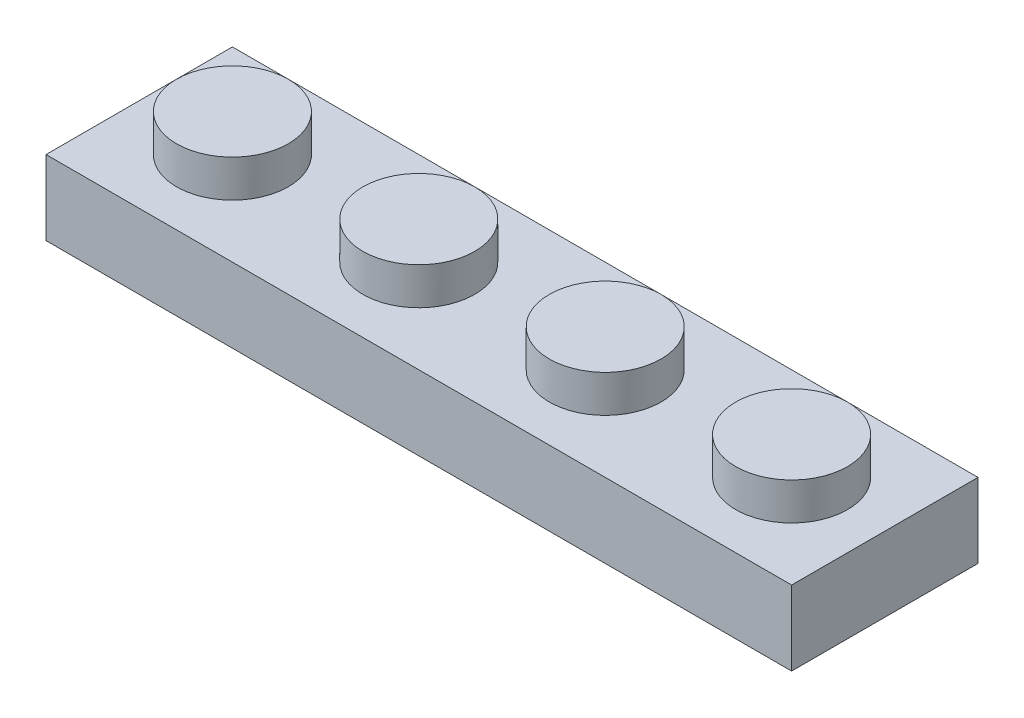
ISO-10303-21;
HEADER;
FILE_DESCRIPTION(('STEP AP214'),'2;1');
FILE_NAME('part.step','',(''),(''),'','','');
FILE_SCHEMA(('AUTOMOTIVE_DESIGN { 1 0 10303 214 1 1 1 1 }'));
ENDSEC;
DATA;
#1=APPLICATION_CONTEXT('core data for automotive mechanical design processes');
#2=APPLICATION_PROTOCOL_DEFINITION('international standard','automotive_design',2000,#1);
#3=PRODUCT_CONTEXT('',#1,'mechanical');
#4=PRODUCT('Part','Part','',(#3));
#5=PRODUCT_RELATED_PRODUCT_CATEGORY('part','',(#4));
#6=PRODUCT_DEFINITION_FORMATION('','',#4);
#7=PRODUCT_DEFINITION_CONTEXT('part definition',#1,'design');
#8=PRODUCT_DEFINITION('design','',#6,#7);
#9=PRODUCT_DEFINITION_SHAPE('','',#8);
#10=(LENGTH_UNIT() NAMED_UNIT(*) SI_UNIT(.MILLI.,.METRE.));
#11=(NAMED_UNIT(*) PLANE_ANGLE_UNIT() SI_UNIT($,.RADIAN.));
#12=(NAMED_UNIT(*) SI_UNIT($,.STERADIAN.) SOLID_ANGLE_UNIT());
#13=UNCERTAINTY_MEASURE_WITH_UNIT(LENGTH_MEASURE(1.E-05),#10,'distance_accuracy_value','');
#14=(GEOMETRIC_REPRESENTATION_CONTEXT(3) GLOBAL_UNCERTAINTY_ASSIGNED_CONTEXT((#13)) GLOBAL_UNIT_ASSIGNED_CONTEXT((#10,
#11,#12)) REPRESENTATION_CONTEXT('',''));
#15=CARTESIAN_POINT('',(0.,0.,0.));
#16=DIRECTION('',(0.,0.,1.));
#17=DIRECTION('',(1.,0.,0.));
#18=AXIS2_PLACEMENT_3D('',#15,#16,#17);
#19=CARTESIAN_POINT('',(0.,0.,0.));
#20=DIRECTION('',(0.,-1.,0.));
#21=DIRECTION('',(0.,0.,-1.));
#22=AXIS2_PLACEMENT_3D('',#19,#20,#21);
#23=PLANE('',#22);
#24=DIRECTION('',(0.,0.,1.));
#25=VECTOR('',#24,1.);
#26=CARTESIAN_POINT('',(0.,0.,0.));
#27=LINE('',#26,#25);
#28=CARTESIAN_POINT('',(0.,0.,-7.9375));
#29=VERTEX_POINT('',#28);
#30=CARTESIAN_POINT('',(0.,0.,0.));
#31=VERTEX_POINT('',#30);
#32=EDGE_CURVE('E198',#29,#31,#27,.T.);
#33=ORIENTED_EDGE('',*,*,#32,.F.);
#34=DIRECTION('',(-1.,0.,0.));
#35=VECTOR('',#34,1.);
#36=CARTESIAN_POINT('',(0.,0.,-7.9375));
#37=LINE('',#36,#35);
#38=CARTESIAN_POINT('',(31.75,0.,-7.9375));
#39=VERTEX_POINT('',#38);
#40=EDGE_CURVE('E89',#39,#29,#37,.T.);
#41=ORIENTED_EDGE('',*,*,#40,.F.);
#42=DIRECTION('',(0.,0.,-1.));
#43=VECTOR('',#42,1.);
#44=CARTESIAN_POINT('',(31.75,0.,0.));
#45=LINE('',#44,#43);
#46=CARTESIAN_POINT('',(31.75,0.,0.));
#47=VERTEX_POINT('',#46);
#48=EDGE_CURVE('E210',#47,#39,#45,.T.);
#49=ORIENTED_EDGE('',*,*,#48,.F.);
#50=DIRECTION('',(1.,0.,0.));
#51=VECTOR('',#50,1.);
#52=CARTESIAN_POINT('',(0.,0.,0.));
#53=LINE('',#52,#51);
#54=EDGE_CURVE('E208',#31,#47,#53,.T.);
#55=ORIENTED_EDGE('',*,*,#54,.F.);
#56=EDGE_LOOP('',(#33,#41,#49,#55));
#57=FACE_BOUND('',#56,.T.);
#58=DIRECTION('',(-1.,0.,0.));
#59=VECTOR('',#58,1.);
#60=CARTESIAN_POINT('',(0.,0.,-6.35));
#61=LINE('',#60,#59);
#62=CARTESIAN_POINT('',(30.1625,0.,-6.35));
#63=VERTEX_POINT('',#62);
#64=CARTESIAN_POINT('',(1.58749999999999,0.,-6.35));
#65=VERTEX_POINT('',#64);
#66=EDGE_CURVE('E137',#63,#65,#61,.T.);
#67=ORIENTED_EDGE('',*,*,#66,.T.);
#68=DIRECTION('',(0.,0.,1.));
#69=VECTOR('',#68,1.);
#70=CARTESIAN_POINT('',(1.5875,0.,0.));
#71=LINE('',#70,#69);
#72=CARTESIAN_POINT('',(1.5875,0.,-1.5875));
#73=VERTEX_POINT('',#72);
#74=EDGE_CURVE('E171',#65,#73,#71,.T.);
#75=ORIENTED_EDGE('',*,*,#74,.T.);
#76=DIRECTION('',(1.,0.,0.));
#77=VECTOR('',#76,1.);
#78=CARTESIAN_POINT('',(0.,0.,-1.5875));
#79=LINE('',#78,#77);
#80=CARTESIAN_POINT('',(30.1625,0.,-1.5875));
#81=VERTEX_POINT('',#80);
#82=EDGE_CURVE('E141',#73,#81,#79,.T.);
#83=ORIENTED_EDGE('',*,*,#82,.T.);
#84=DIRECTION('',(0.,0.,-1.));
#85=VECTOR('',#84,1.);
#86=CARTESIAN_POINT('',(30.1625,0.,0.));
#87=LINE('',#86,#85);
#88=EDGE_CURVE('E59',#81,#63,#87,.T.);
#89=ORIENTED_EDGE('',*,*,#88,.T.);
#90=EDGE_LOOP('',(#67,#75,#83,#89));
#91=FACE_BOUND('',#90,.T.);
#92=ADVANCED_FACE('F44',(#57,#91),#23,.T.);
#93=CARTESIAN_POINT('',(0.,3.175,0.));
#94=DIRECTION('',(1.,0.,0.));
#95=DIRECTION('',(0.,0.,-1.));
#96=AXIS2_PLACEMENT_3D('',#93,#94,#95);
#97=PLANE('',#96);
#98=ORIENTED_EDGE('',*,*,#32,.T.);
#99=DIRECTION('',(0.,-1.,0.));
#100=VECTOR('',#99,1.);
#101=CARTESIAN_POINT('',(0.,3.175,0.));
#102=LINE('',#101,#100);
#103=CARTESIAN_POINT('',(0.,3.175,0.));
#104=VERTEX_POINT('',#103);
#105=EDGE_CURVE('E219',#104,#31,#102,.T.);
#106=ORIENTED_EDGE('',*,*,#105,.F.);
#107=DIRECTION('',(0.,0.,1.));
#108=VECTOR('',#107,1.);
#109=CARTESIAN_POINT('',(0.,3.175,0.));
#110=LINE('',#109,#108);
#111=CARTESIAN_POINT('',(0.,3.175,-7.9375));
#112=VERTEX_POINT('',#111);
#113=EDGE_CURVE('E199',#112,#104,#110,.T.);
#114=ORIENTED_EDGE('',*,*,#113,.F.);
#115=DIRECTION('',(0.,-1.,0.));
#116=VECTOR('',#115,1.);
#117=CARTESIAN_POINT('',(0.,3.175,-7.9375));
#118=LINE('',#117,#116);
#119=EDGE_CURVE('E205',#112,#29,#118,.T.);
#120=ORIENTED_EDGE('',*,*,#119,.T.);
#121=EDGE_LOOP('',(#98,#106,#114,#120));
#122=FACE_BOUND('',#121,.T.);
#123=ADVANCED_FACE('F46',(#122),#97,.F.);
#124=CARTESIAN_POINT('',(0.,3.175,0.));
#125=DIRECTION('',(0.,0.,-1.));
#126=DIRECTION('',(-1.,0.,0.));
#127=AXIS2_PLACEMENT_3D('',#124,#125,#126);
#128=PLANE('',#127);
#129=ORIENTED_EDGE('',*,*,#54,.T.);
#130=DIRECTION('',(0.,-1.,0.));
#131=VECTOR('',#130,1.);
#132=CARTESIAN_POINT('',(31.75,3.175,0.));
#133=LINE('',#132,#131);
#134=CARTESIAN_POINT('',(31.75,3.175,0.));
#135=VERTEX_POINT('',#134);
#136=EDGE_CURVE('E216',#135,#47,#133,.T.);
#137=ORIENTED_EDGE('',*,*,#136,.F.);
#138=DIRECTION('',(1.,0.,0.));
#139=VECTOR('',#138,1.);
#140=CARTESIAN_POINT('',(0.,3.175,0.));
#141=LINE('',#140,#139);
#142=EDGE_CURVE('E97',#104,#135,#141,.T.);
#143=ORIENTED_EDGE('',*,*,#142,.F.);
#144=ORIENTED_EDGE('',*,*,#105,.T.);
#145=EDGE_LOOP('',(#129,#137,#143,#144));
#146=FACE_BOUND('',#145,.T.);
#147=ADVANCED_FACE('F271',(#146),#128,.F.);
#148=CARTESIAN_POINT('',(31.75,3.175,0.));
#149=DIRECTION('',(-1.,0.,0.));
#150=DIRECTION('',(0.,0.,1.));
#151=AXIS2_PLACEMENT_3D('',#148,#149,#150);
#152=PLANE('',#151);
#153=ORIENTED_EDGE('',*,*,#48,.T.);
#154=DIRECTION('',(0.,-1.,0.));
#155=VECTOR('',#154,1.);
#156=CARTESIAN_POINT('',(31.75,3.175,-7.9375));
#157=LINE('',#156,#155);
#158=CARTESIAN_POINT('',(31.75,3.175,-7.9375));
#159=VERTEX_POINT('',#158);
#160=EDGE_CURVE('E214',#159,#39,#157,.T.);
#161=ORIENTED_EDGE('',*,*,#160,.F.);
#162=DIRECTION('',(0.,0.,-1.));
#163=VECTOR('',#162,1.);
#164=CARTESIAN_POINT('',(31.75,3.175,0.));
#165=LINE('',#164,#163);
#166=EDGE_CURVE('E202',#135,#159,#165,.T.);
#167=ORIENTED_EDGE('',*,*,#166,.F.);
#168=ORIENTED_EDGE('',*,*,#136,.T.);
#169=EDGE_LOOP('',(#153,#161,#167,#168));
#170=FACE_BOUND('',#169,.T.);
#171=ADVANCED_FACE('F282',(#170),#152,.F.);
#172=CARTESIAN_POINT('',(0.,3.175,-7.9375));
#173=DIRECTION('',(0.,0.,1.));
#174=DIRECTION('',(1.,0.,0.));
#175=AXIS2_PLACEMENT_3D('',#172,#173,#174);
#176=PLANE('',#175);
#177=ORIENTED_EDGE('',*,*,#40,.T.);
#178=ORIENTED_EDGE('',*,*,#119,.F.);
#179=DIRECTION('',(-1.,0.,0.));
#180=VECTOR('',#179,1.);
#181=CARTESIAN_POINT('',(0.,3.175,-7.9375));
#182=LINE('',#181,#180);
#183=EDGE_CURVE('E68',#159,#112,#182,.T.);
#184=ORIENTED_EDGE('',*,*,#183,.F.);
#185=ORIENTED_EDGE('',*,*,#160,.T.);
#186=EDGE_LOOP('',(#177,#178,#184,#185));
#187=FACE_BOUND('',#186,.T.);
#188=ADVANCED_FACE('F279',(#187),#176,.F.);
#189=CARTESIAN_POINT('',(0.,3.175,0.));
#190=DIRECTION('',(0.,-1.,0.));
#191=DIRECTION('',(0.,0.,-1.));
#192=AXIS2_PLACEMENT_3D('',#189,#190,#191);
#193=PLANE('',#192);
#194=CARTESIAN_POINT('',(27.78125,3.175,-3.96875));
#195=DIRECTION('',(0.,-1.,0.));
#196=DIRECTION('',(0.,0.,-1.));
#197=AXIS2_PLACEMENT_3D('',#194,#195,#196);
#198=CIRCLE('',#197,2.38125);
#199=CARTESIAN_POINT('',(27.78125,3.175,-6.35));
#200=VERTEX_POINT('',#199);
#201=EDGE_CURVE('E230',#200,#200,#198,.F.);
#202=ORIENTED_EDGE('',*,*,#201,.F.);
#203=EDGE_LOOP('',(#202));
#204=FACE_BOUND('',#203,.T.);
#205=CARTESIAN_POINT('',(19.84375,3.175,-3.96875));
#206=DIRECTION('',(0.,-1.,0.));
#207=DIRECTION('',(0.,0.,-1.));
#208=AXIS2_PLACEMENT_3D('',#205,#206,#207);
#209=CIRCLE('',#208,2.38125);
#210=CARTESIAN_POINT('',(19.84375,3.175,-6.35));
#211=VERTEX_POINT('',#210);
#212=EDGE_CURVE('E227',#211,#211,#209,.F.);
#213=ORIENTED_EDGE('',*,*,#212,.F.);
#214=EDGE_LOOP('',(#213));
#215=FACE_BOUND('',#214,.T.);
#216=CARTESIAN_POINT('',(11.90625,3.175,-3.96875));
#217=DIRECTION('',(0.,-1.,0.));
#218=DIRECTION('',(0.,0.,-1.));
#219=AXIS2_PLACEMENT_3D('',#216,#217,#218);
#220=CIRCLE('',#219,2.38125);
#221=CARTESIAN_POINT('',(11.90625,3.175,-6.35));
#222=VERTEX_POINT('',#221);
#223=EDGE_CURVE('E224',#222,#222,#220,.F.);
#224=ORIENTED_EDGE('',*,*,#223,.F.);
#225=EDGE_LOOP('',(#224));
#226=FACE_BOUND('',#225,.T.);
#227=CARTESIAN_POINT('',(3.96875,3.175,-3.96875));
#228=DIRECTION('',(0.,-1.,0.));
#229=DIRECTION('',(0.,0.,-1.));
#230=AXIS2_PLACEMENT_3D('',#227,#228,#229);
#231=CIRCLE('',#230,2.38125);
#232=CARTESIAN_POINT('',(3.96875,3.175,-6.35));
#233=VERTEX_POINT('',#232);
#234=EDGE_CURVE('E221',#233,#233,#231,.F.);
#235=ORIENTED_EDGE('',*,*,#234,.F.);
#236=EDGE_LOOP('',(#235));
#237=FACE_BOUND('',#236,.T.);
#238=ORIENTED_EDGE('',*,*,#113,.T.);
#239=ORIENTED_EDGE('',*,*,#142,.T.);
#240=ORIENTED_EDGE('',*,*,#166,.T.);
#241=ORIENTED_EDGE('',*,*,#183,.T.);
#242=EDGE_LOOP('',(#238,#239,#240,#241));
#243=FACE_BOUND('',#242,.T.);
#244=ADVANCED_FACE('F277',(#204,#215,#226,#237,#243),#193,.F.);
#245=CARTESIAN_POINT('',(3.96875,4.7625,-3.96875));
#246=DIRECTION('',(0.,-1.,0.));
#247=DIRECTION('',(0.,0.,-1.));
#248=AXIS2_PLACEMENT_3D('',#245,#246,#247);
#249=CYLINDRICAL_SURFACE('',#248,2.38125);
#250=CARTESIAN_POINT('',(3.96875,4.7625,-3.96875));
#251=DIRECTION('',(0.,1.,0.));
#252=DIRECTION('',(0.,0.,1.));
#253=AXIS2_PLACEMENT_3D('',#250,#251,#252);
#254=CIRCLE('',#253,2.38125);
#255=CARTESIAN_POINT('',(3.96875,4.7625,-1.5875));
#256=VERTEX_POINT('',#255);
#257=EDGE_CURVE('E195',#256,#256,#254,.T.);
#258=ORIENTED_EDGE('',*,*,#257,.F.);
#259=EDGE_LOOP('',(#258));
#260=FACE_BOUND('',#259,.T.);
#261=ORIENTED_EDGE('',*,*,#234,.T.);
#262=EDGE_LOOP('',(#261));
#263=FACE_BOUND('',#262,.T.);
#264=ADVANCED_FACE('F294',(#260,#263),#249,.T.);
#265=CARTESIAN_POINT('',(3.96875,4.7625,-3.96875));
#266=DIRECTION('',(0.,1.,0.));
#267=DIRECTION('',(0.,0.,1.));
#268=AXIS2_PLACEMENT_3D('',#265,#266,#267);
#269=PLANE('',#268);
#270=ORIENTED_EDGE('',*,*,#257,.T.);
#271=EDGE_LOOP('',(#270));
#272=FACE_BOUND('',#271,.T.);
#273=ADVANCED_FACE('F299',(#272),#269,.T.);
#274=CARTESIAN_POINT('',(11.90625,4.7625,-3.96875));
#275=DIRECTION('',(0.,-1.,0.));
#276=DIRECTION('',(0.,0.,-1.));
#277=AXIS2_PLACEMENT_3D('',#274,#275,#276);
#278=CYLINDRICAL_SURFACE('',#277,2.38125);
#279=CARTESIAN_POINT('',(11.90625,4.7625,-3.96875));
#280=DIRECTION('',(0.,1.,0.));
#281=DIRECTION('',(0.,0.,1.));
#282=AXIS2_PLACEMENT_3D('',#279,#280,#281);
#283=CIRCLE('',#282,2.38125);
#284=CARTESIAN_POINT('',(11.90625,4.7625,-1.5875));
#285=VERTEX_POINT('',#284);
#286=EDGE_CURVE('E192',#285,#285,#283,.T.);
#287=ORIENTED_EDGE('',*,*,#286,.F.);
#288=EDGE_LOOP('',(#287));
#289=FACE_BOUND('',#288,.T.);
#290=ORIENTED_EDGE('',*,*,#223,.T.);
#291=EDGE_LOOP('',(#290));
#292=FACE_BOUND('',#291,.T.);
#293=ADVANCED_FACE('F310',(#289,#292),#278,.T.);
#294=CARTESIAN_POINT('',(11.90625,4.7625,-3.96875));
#295=DIRECTION('',(0.,1.,0.));
#296=DIRECTION('',(0.,0.,1.));
#297=AXIS2_PLACEMENT_3D('',#294,#295,#296);
#298=PLANE('',#297);
#299=ORIENTED_EDGE('',*,*,#286,.T.);
#300=EDGE_LOOP('',(#299));
#301=FACE_BOUND('',#300,.T.);
#302=ADVANCED_FACE('F312',(#301),#298,.T.);
#303=CARTESIAN_POINT('',(19.84375,4.7625,-3.96875));
#304=DIRECTION('',(0.,-1.,0.));
#305=DIRECTION('',(0.,0.,-1.));
#306=AXIS2_PLACEMENT_3D('',#303,#304,#305);
#307=CYLINDRICAL_SURFACE('',#306,2.38125);
#308=CARTESIAN_POINT('',(19.84375,4.7625,-3.96875));
#309=DIRECTION('',(0.,1.,0.));
#310=DIRECTION('',(0.,0.,1.));
#311=AXIS2_PLACEMENT_3D('',#308,#309,#310);
#312=CIRCLE('',#311,2.38125);
#313=CARTESIAN_POINT('',(19.84375,4.7625,-1.5875));
#314=VERTEX_POINT('',#313);
#315=EDGE_CURVE('E189',#314,#314,#312,.T.);
#316=ORIENTED_EDGE('',*,*,#315,.F.);
#317=EDGE_LOOP('',(#316));
#318=FACE_BOUND('',#317,.T.);
#319=ORIENTED_EDGE('',*,*,#212,.T.);
#320=EDGE_LOOP('',(#319));
#321=FACE_BOUND('',#320,.T.);
#322=ADVANCED_FACE('F319',(#318,#321),#307,.T.);
#323=CARTESIAN_POINT('',(19.84375,4.7625,-3.96875));
#324=DIRECTION('',(0.,1.,0.));
#325=DIRECTION('',(0.,0.,1.));
#326=AXIS2_PLACEMENT_3D('',#323,#324,#325);
#327=PLANE('',#326);
#328=ORIENTED_EDGE('',*,*,#315,.T.);
#329=EDGE_LOOP('',(#328));
#330=FACE_BOUND('',#329,.T.);
#331=ADVANCED_FACE('F328',(#330),#327,.T.);
#332=CARTESIAN_POINT('',(27.78125,4.7625,-3.96875));
#333=DIRECTION('',(0.,-1.,0.));
#334=DIRECTION('',(0.,0.,-1.));
#335=AXIS2_PLACEMENT_3D('',#332,#333,#334);
#336=CYLINDRICAL_SURFACE('',#335,2.38125);
#337=CARTESIAN_POINT('',(27.78125,4.7625,-3.96875));
#338=DIRECTION('',(0.,1.,0.));
#339=DIRECTION('',(0.,0.,1.));
#340=AXIS2_PLACEMENT_3D('',#337,#338,#339);
#341=CIRCLE('',#340,2.38125);
#342=CARTESIAN_POINT('',(27.78125,4.7625,-1.5875));
#343=VERTEX_POINT('',#342);
#344=EDGE_CURVE('E162',#343,#343,#341,.T.);
#345=ORIENTED_EDGE('',*,*,#344,.F.);
#346=EDGE_LOOP('',(#345));
#347=FACE_BOUND('',#346,.T.);
#348=ORIENTED_EDGE('',*,*,#201,.T.);
#349=EDGE_LOOP('',(#348));
#350=FACE_BOUND('',#349,.T.);
#351=ADVANCED_FACE('F332',(#347,#350),#336,.T.);
#352=CARTESIAN_POINT('',(27.78125,4.7625,-3.96875));
#353=DIRECTION('',(0.,1.,0.));
#354=DIRECTION('',(0.,0.,1.));
#355=AXIS2_PLACEMENT_3D('',#352,#353,#354);
#356=PLANE('',#355);
#357=ORIENTED_EDGE('',*,*,#344,.T.);
#358=EDGE_LOOP('',(#357));
#359=FACE_BOUND('',#358,.T.);
#360=ADVANCED_FACE('F336',(#359),#356,.T.);
#361=CARTESIAN_POINT('',(1.5875,3.175,0.));
#362=DIRECTION('',(1.,0.,0.));
#363=DIRECTION('',(0.,0.,-1.));
#364=AXIS2_PLACEMENT_3D('',#361,#362,#363);
#365=PLANE('',#364);
#366=ORIENTED_EDGE('',*,*,#74,.F.);
#367=DIRECTION('',(0.,-1.,0.));
#368=VECTOR('',#367,1.);
#369=CARTESIAN_POINT('',(1.58749999999999,3.175,-6.35));
#370=LINE('',#369,#368);
#371=CARTESIAN_POINT('',(1.58749999999999,1.5875,-6.35));
#372=VERTEX_POINT('',#371);
#373=EDGE_CURVE('E136',#372,#65,#370,.T.);
#374=ORIENTED_EDGE('',*,*,#373,.F.);
#375=DIRECTION('',(0.,0.,1.));
#376=VECTOR('',#375,1.);
#377=CARTESIAN_POINT('',(1.5875,1.5875,0.));
#378=LINE('',#377,#376);
#379=CARTESIAN_POINT('',(1.5875,1.5875,-1.5875));
#380=VERTEX_POINT('',#379);
#381=EDGE_CURVE('E124',#372,#380,#378,.T.);
#382=ORIENTED_EDGE('',*,*,#381,.T.);
#383=DIRECTION('',(0.,-1.,0.));
#384=VECTOR('',#383,1.);
#385=CARTESIAN_POINT('',(1.5875,3.175,-1.5875));
#386=LINE('',#385,#384);
#387=EDGE_CURVE('E134',#380,#73,#386,.T.);
#388=ORIENTED_EDGE('',*,*,#387,.T.);
#389=EDGE_LOOP('',(#366,#374,#382,#388));
#390=FACE_BOUND('',#389,.T.);
#391=ADVANCED_FACE('F133',(#390),#365,.T.);
#392=CARTESIAN_POINT('',(0.,3.175,-1.5875));
#393=DIRECTION('',(0.,0.,-1.));
#394=DIRECTION('',(-1.,0.,0.));
#395=AXIS2_PLACEMENT_3D('',#392,#393,#394);
#396=PLANE('',#395);
#397=ORIENTED_EDGE('',*,*,#82,.F.);
#398=ORIENTED_EDGE('',*,*,#387,.F.);
#399=DIRECTION('',(1.,0.,0.));
#400=VECTOR('',#399,1.);
#401=CARTESIAN_POINT('',(0.,1.5875,-1.5875));
#402=LINE('',#401,#400);
#403=CARTESIAN_POINT('',(30.1625,1.5875,-1.5875));
#404=VERTEX_POINT('',#403);
#405=EDGE_CURVE('E120',#380,#404,#402,.T.);
#406=ORIENTED_EDGE('',*,*,#405,.T.);
#407=DIRECTION('',(0.,-1.,0.));
#408=VECTOR('',#407,1.);
#409=CARTESIAN_POINT('',(30.1625,3.175,-1.5875));
#410=LINE('',#409,#408);
#411=EDGE_CURVE('E143',#404,#81,#410,.T.);
#412=ORIENTED_EDGE('',*,*,#411,.T.);
#413=EDGE_LOOP('',(#397,#398,#406,#412));
#414=FACE_BOUND('',#413,.T.);
#415=ADVANCED_FACE('F139',(#414),#396,.T.);
#416=CARTESIAN_POINT('',(30.1625,3.175,0.));
#417=DIRECTION('',(-1.,0.,0.));
#418=DIRECTION('',(0.,0.,1.));
#419=AXIS2_PLACEMENT_3D('',#416,#417,#418);
#420=PLANE('',#419);
#421=ORIENTED_EDGE('',*,*,#88,.F.);
#422=ORIENTED_EDGE('',*,*,#411,.F.);
#423=DIRECTION('',(0.,0.,-1.));
#424=VECTOR('',#423,1.);
#425=CARTESIAN_POINT('',(30.1625,1.5875,0.));
#426=LINE('',#425,#424);
#427=CARTESIAN_POINT('',(30.1625,1.5875,-6.35));
#428=VERTEX_POINT('',#427);
#429=EDGE_CURVE('E125',#404,#428,#426,.T.);
#430=ORIENTED_EDGE('',*,*,#429,.T.);
#431=DIRECTION('',(0.,-1.,0.));
#432=VECTOR('',#431,1.);
#433=CARTESIAN_POINT('',(30.1625,3.175,-6.35));
#434=LINE('',#433,#432);
#435=EDGE_CURVE('E148',#428,#63,#434,.T.);
#436=ORIENTED_EDGE('',*,*,#435,.T.);
#437=EDGE_LOOP('',(#421,#422,#430,#436));
#438=FACE_BOUND('',#437,.T.);
#439=ADVANCED_FACE('F384',(#438),#420,.T.);
#440=CARTESIAN_POINT('',(0.,3.175,-6.35));
#441=DIRECTION('',(0.,0.,1.));
#442=DIRECTION('',(1.,0.,0.));
#443=AXIS2_PLACEMENT_3D('',#440,#441,#442);
#444=PLANE('',#443);
#445=ORIENTED_EDGE('',*,*,#66,.F.);
#446=ORIENTED_EDGE('',*,*,#435,.F.);
#447=DIRECTION('',(-1.,0.,0.));
#448=VECTOR('',#447,1.);
#449=CARTESIAN_POINT('',(0.,1.5875,-6.35));
#450=LINE('',#449,#448);
#451=EDGE_CURVE('E154',#428,#372,#450,.T.);
#452=ORIENTED_EDGE('',*,*,#451,.T.);
#453=ORIENTED_EDGE('',*,*,#373,.T.);
#454=EDGE_LOOP('',(#445,#446,#452,#453));
#455=FACE_BOUND('',#454,.T.);
#456=ADVANCED_FACE('F375',(#455),#444,.T.);
#457=CARTESIAN_POINT('',(0.,1.5875,0.));
#458=DIRECTION('',(0.,-1.,0.));
#459=DIRECTION('',(0.,0.,-1.));
#460=AXIS2_PLACEMENT_3D('',#457,#458,#459);
#461=PLANE('',#460);
#462=CARTESIAN_POINT('',(23.415625,1.5875,-3.96875));
#463=DIRECTION('',(0.,-1.,0.));
#464=DIRECTION('',(0.,0.,-1.));
#465=AXIS2_PLACEMENT_3D('',#462,#463,#464);
#466=CIRCLE('',#465,1.5875);
#467=CARTESIAN_POINT('',(23.415625,1.5875,-5.55625));
#468=VERTEX_POINT('',#467);
#469=EDGE_CURVE('E389',#468,#468,#466,.T.);
#470=ORIENTED_EDGE('',*,*,#469,.F.);
#471=EDGE_LOOP('',(#470));
#472=FACE_BOUND('',#471,.T.);
#473=CARTESIAN_POINT('',(15.478125,1.5875,-3.96875));
#474=DIRECTION('',(0.,-1.,0.));
#475=DIRECTION('',(0.,0.,-1.));
#476=AXIS2_PLACEMENT_3D('',#473,#474,#475);
#477=CIRCLE('',#476,1.5875);
#478=CARTESIAN_POINT('',(15.478125,1.5875,-5.55625));
#479=VERTEX_POINT('',#478);
#480=EDGE_CURVE('E393',#479,#479,#477,.T.);
#481=ORIENTED_EDGE('',*,*,#480,.F.);
#482=EDGE_LOOP('',(#481));
#483=FACE_BOUND('',#482,.T.);
#484=CARTESIAN_POINT('',(7.540625,1.5875,-3.96875));
#485=DIRECTION('',(0.,-1.,0.));
#486=DIRECTION('',(0.,0.,-1.));
#487=AXIS2_PLACEMENT_3D('',#484,#485,#486);
#488=CIRCLE('',#487,1.5875);
#489=CARTESIAN_POINT('',(7.540625,1.5875,-5.55625));
#490=VERTEX_POINT('',#489);
#491=EDGE_CURVE('E151',#490,#490,#488,.T.);
#492=ORIENTED_EDGE('',*,*,#491,.F.);
#493=EDGE_LOOP('',(#492));
#494=FACE_BOUND('',#493,.T.);
#495=CARTESIAN_POINT('',(27.78125,1.5875,-3.96875));
#496=DIRECTION('',(0.,-1.,0.));
#497=DIRECTION('',(0.,0.,-1.));
#498=AXIS2_PLACEMENT_3D('',#495,#496,#497);
#499=CIRCLE('',#498,0.793750000000002);
#500=CARTESIAN_POINT('',(27.78125,1.5875,-4.7625));
#501=VERTEX_POINT('',#500);
#502=EDGE_CURVE('E159',#501,#501,#499,.F.);
#503=ORIENTED_EDGE('',*,*,#502,.T.);
#504=EDGE_LOOP('',(#503));
#505=FACE_BOUND('',#504,.T.);
#506=CARTESIAN_POINT('',(19.84375,1.5875,-3.96875));
#507=DIRECTION('',(0.,-1.,0.));
#508=DIRECTION('',(0.,0.,-1.));
#509=AXIS2_PLACEMENT_3D('',#506,#507,#508);
#510=CIRCLE('',#509,0.793750000000002);
#511=CARTESIAN_POINT('',(19.84375,1.5875,-4.7625));
#512=VERTEX_POINT('',#511);
#513=EDGE_CURVE('E163',#512,#512,#510,.F.);
#514=ORIENTED_EDGE('',*,*,#513,.T.);
#515=EDGE_LOOP('',(#514));
#516=FACE_BOUND('',#515,.T.);
#517=CARTESIAN_POINT('',(11.90625,1.5875,-3.96875));
#518=DIRECTION('',(0.,-1.,0.));
#519=DIRECTION('',(0.,0.,-1.));
#520=AXIS2_PLACEMENT_3D('',#517,#518,#519);
#521=CIRCLE('',#520,0.79375);
#522=CARTESIAN_POINT('',(11.90625,1.5875,-4.7625));
#523=VERTEX_POINT('',#522);
#524=EDGE_CURVE('E146',#523,#523,#521,.F.);
#525=ORIENTED_EDGE('',*,*,#524,.T.);
#526=EDGE_LOOP('',(#525));
#527=FACE_BOUND('',#526,.T.);
#528=CARTESIAN_POINT('',(3.96875,1.5875,-3.96875));
#529=DIRECTION('',(0.,-1.,0.));
#530=DIRECTION('',(0.,0.,-1.));
#531=AXIS2_PLACEMENT_3D('',#528,#529,#530);
#532=CIRCLE('',#531,0.793750000000001);
#533=CARTESIAN_POINT('',(3.96875,1.5875,-4.7625));
#534=VERTEX_POINT('',#533);
#535=EDGE_CURVE('E142',#534,#534,#532,.F.);
#536=ORIENTED_EDGE('',*,*,#535,.T.);
#537=EDGE_LOOP('',(#536));
#538=FACE_BOUND('',#537,.T.);
#539=ORIENTED_EDGE('',*,*,#381,.F.);
#540=ORIENTED_EDGE('',*,*,#451,.F.);
#541=ORIENTED_EDGE('',*,*,#429,.F.);
#542=ORIENTED_EDGE('',*,*,#405,.F.);
#543=EDGE_LOOP('',(#539,#540,#541,#542));
#544=FACE_BOUND('',#543,.T.);
#545=ADVANCED_FACE('F122',(#472,#483,#494,#505,#516,#527,#538,#544),#461,.T.);
#546=CARTESIAN_POINT('',(3.96875,4.7625,-3.96875));
#547=DIRECTION('',(0.,-1.,0.));
#548=DIRECTION('',(0.,0.,-1.));
#549=AXIS2_PLACEMENT_3D('',#546,#547,#548);
#550=CYLINDRICAL_SURFACE('',#549,0.793750000000001);
#551=CARTESIAN_POINT('',(3.96875,3.175,-3.96875));
#552=DIRECTION('',(0.,1.,0.));
#553=DIRECTION('',(0.,0.,1.));
#554=AXIS2_PLACEMENT_3D('',#551,#552,#553);
#555=CIRCLE('',#554,0.793750000000001);
#556=CARTESIAN_POINT('',(3.96875,3.175,-3.175));
#557=VERTEX_POINT('',#556);
#558=EDGE_CURVE('E168',#557,#557,#555,.T.);
#559=ORIENTED_EDGE('',*,*,#558,.T.);
#560=EDGE_LOOP('',(#559));
#561=FACE_BOUND('',#560,.T.);
#562=ORIENTED_EDGE('',*,*,#535,.F.);
#563=EDGE_LOOP('',(#562));
#564=FACE_BOUND('',#563,.T.);
#565=ADVANCED_FACE('F368',(#561,#564),#550,.F.);
#566=CARTESIAN_POINT('',(3.96875,3.175,-3.96875));
#567=DIRECTION('',(0.,1.,0.));
#568=DIRECTION('',(0.,0.,1.));
#569=AXIS2_PLACEMENT_3D('',#566,#567,#568);
#570=PLANE('',#569);
#571=ORIENTED_EDGE('',*,*,#558,.F.);
#572=EDGE_LOOP('',(#571));
#573=FACE_BOUND('',#572,.T.);
#574=ADVANCED_FACE('F365',(#573),#570,.F.);
#575=CARTESIAN_POINT('',(11.90625,4.7625,-3.96875));
#576=DIRECTION('',(0.,-1.,0.));
#577=DIRECTION('',(0.,0.,-1.));
#578=AXIS2_PLACEMENT_3D('',#575,#576,#577);
#579=CYLINDRICAL_SURFACE('',#578,0.79375);
#580=CARTESIAN_POINT('',(11.90625,3.175,-3.96875));
#581=DIRECTION('',(0.,1.,0.));
#582=DIRECTION('',(0.,0.,1.));
#583=AXIS2_PLACEMENT_3D('',#580,#581,#582);
#584=CIRCLE('',#583,0.79375);
#585=CARTESIAN_POINT('',(11.90625,3.175,-3.175));
#586=VERTEX_POINT('',#585);
#587=EDGE_CURVE('E172',#586,#586,#584,.T.);
#588=ORIENTED_EDGE('',*,*,#587,.T.);
#589=EDGE_LOOP('',(#588));
#590=FACE_BOUND('',#589,.T.);
#591=ORIENTED_EDGE('',*,*,#524,.F.);
#592=EDGE_LOOP('',(#591));
#593=FACE_BOUND('',#592,.T.);
#594=ADVANCED_FACE('F361',(#590,#593),#579,.F.);
#595=CARTESIAN_POINT('',(11.90625,3.175,-3.96875));
#596=DIRECTION('',(0.,1.,0.));
#597=DIRECTION('',(0.,0.,1.));
#598=AXIS2_PLACEMENT_3D('',#595,#596,#597);
#599=PLANE('',#598);
#600=ORIENTED_EDGE('',*,*,#587,.F.);
#601=EDGE_LOOP('',(#600));
#602=FACE_BOUND('',#601,.T.);
#603=ADVANCED_FACE('F357',(#602),#599,.F.);
#604=CARTESIAN_POINT('',(19.84375,4.7625,-3.96875));
#605=DIRECTION('',(0.,-1.,0.));
#606=DIRECTION('',(0.,0.,-1.));
#607=AXIS2_PLACEMENT_3D('',#604,#605,#606);
#608=CYLINDRICAL_SURFACE('',#607,0.793750000000002);
#609=CARTESIAN_POINT('',(19.84375,3.175,-3.96875));
#610=DIRECTION('',(0.,1.,0.));
#611=DIRECTION('',(0.,0.,1.));
#612=AXIS2_PLACEMENT_3D('',#609,#610,#611);
#613=CIRCLE('',#612,0.793750000000002);
#614=CARTESIAN_POINT('',(19.84375,3.175,-3.175));
#615=VERTEX_POINT('',#614);
#616=EDGE_CURVE('E175',#615,#615,#613,.T.);
#617=ORIENTED_EDGE('',*,*,#616,.T.);
#618=EDGE_LOOP('',(#617));
#619=FACE_BOUND('',#618,.T.);
#620=ORIENTED_EDGE('',*,*,#513,.F.);
#621=EDGE_LOOP('',(#620));
#622=FACE_BOUND('',#621,.T.);
#623=ADVANCED_FACE('F353',(#619,#622),#608,.F.);
#624=CARTESIAN_POINT('',(19.84375,3.175,-3.96875));
#625=DIRECTION('',(0.,1.,0.));
#626=DIRECTION('',(0.,0.,1.));
#627=AXIS2_PLACEMENT_3D('',#624,#625,#626);
#628=PLANE('',#627);
#629=ORIENTED_EDGE('',*,*,#616,.F.);
#630=EDGE_LOOP('',(#629));
#631=FACE_BOUND('',#630,.T.);
#632=ADVANCED_FACE('F349',(#631),#628,.F.);
#633=CARTESIAN_POINT('',(27.78125,4.7625,-3.96875));
#634=DIRECTION('',(0.,-1.,0.));
#635=DIRECTION('',(0.,0.,-1.));
#636=AXIS2_PLACEMENT_3D('',#633,#634,#635);
#637=CYLINDRICAL_SURFACE('',#636,0.793750000000002);
#638=CARTESIAN_POINT('',(27.78125,3.175,-3.96875));
#639=DIRECTION('',(0.,1.,0.));
#640=DIRECTION('',(0.,0.,1.));
#641=AXIS2_PLACEMENT_3D('',#638,#639,#640);
#642=CIRCLE('',#641,0.793750000000002);
#643=CARTESIAN_POINT('',(27.78125,3.175,-3.175));
#644=VERTEX_POINT('',#643);
#645=EDGE_CURVE('E178',#644,#644,#642,.T.);
#646=ORIENTED_EDGE('',*,*,#645,.T.);
#647=EDGE_LOOP('',(#646));
#648=FACE_BOUND('',#647,.T.);
#649=ORIENTED_EDGE('',*,*,#502,.F.);
#650=EDGE_LOOP('',(#649));
#651=FACE_BOUND('',#650,.T.);
#652=ADVANCED_FACE('F345',(#648,#651),#637,.F.);
#653=CARTESIAN_POINT('',(27.78125,3.175,-3.96875));
#654=DIRECTION('',(0.,1.,0.));
#655=DIRECTION('',(0.,0.,1.));
#656=AXIS2_PLACEMENT_3D('',#653,#654,#655);
#657=PLANE('',#656);
#658=ORIENTED_EDGE('',*,*,#645,.F.);
#659=EDGE_LOOP('',(#658));
#660=FACE_BOUND('',#659,.T.);
#661=ADVANCED_FACE('F341',(#660),#657,.F.);
#662=CARTESIAN_POINT('',(7.540625,0.1905,-3.96875));
#663=DIRECTION('',(0.,-1.,0.));
#664=DIRECTION('',(0.,0.,-1.));
#665=AXIS2_PLACEMENT_3D('',#662,#663,#664);
#666=PLANE('',#665);
#667=CARTESIAN_POINT('',(7.540625,0.1905,-3.96875));
#668=DIRECTION('',(0.,-1.,0.));
#669=DIRECTION('',(0.,0.,-1.));
#670=AXIS2_PLACEMENT_3D('',#667,#668,#669);
#671=CIRCLE('',#670,1.5875);
#672=CARTESIAN_POINT('',(7.540625,0.1905,-5.55625));
#673=VERTEX_POINT('',#672);
#674=EDGE_CURVE('E181',#673,#673,#671,.T.);
#675=ORIENTED_EDGE('',*,*,#674,.T.);
#676=EDGE_LOOP('',(#675));
#677=FACE_BOUND('',#676,.T.);
#678=CARTESIAN_POINT('',(7.540625,0.1905,-3.96875));
#679=DIRECTION('',(0.,-1.,0.));
#680=DIRECTION('',(0.,0.,-1.));
#681=AXIS2_PLACEMENT_3D('',#678,#679,#680);
#682=CIRCLE('',#681,0.793750000000001);
#683=CARTESIAN_POINT('',(7.540625,0.1905,-4.7625));
#684=VERTEX_POINT('',#683);
#685=EDGE_CURVE('E406',#684,#684,#682,.T.);
#686=ORIENTED_EDGE('',*,*,#685,.F.);
#687=EDGE_LOOP('',(#686));
#688=FACE_BOUND('',#687,.T.);
#689=ADVANCED_FACE('F344',(#677,#688),#666,.T.);
#690=CARTESIAN_POINT('',(7.540625,0.1905,-3.96875));
#691=DIRECTION('',(0.,1.,0.));
#692=DIRECTION('',(0.,0.,1.));
#693=AXIS2_PLACEMENT_3D('',#690,#691,#692);
#694=CYLINDRICAL_SURFACE('',#693,1.5875);
#695=ORIENTED_EDGE('',*,*,#674,.F.);
#696=EDGE_LOOP('',(#695));
#697=FACE_BOUND('',#696,.T.);
#698=ORIENTED_EDGE('',*,*,#491,.T.);
#699=EDGE_LOOP('',(#698));
#700=FACE_BOUND('',#699,.T.);
#701=ADVANCED_FACE('F447',(#697,#700),#694,.T.);
#702=CARTESIAN_POINT('',(7.540625,0.1905,-3.96875));
#703=DIRECTION('',(0.,1.,0.));
#704=DIRECTION('',(0.,0.,1.));
#705=AXIS2_PLACEMENT_3D('',#702,#703,#704);
#706=CYLINDRICAL_SURFACE('',#705,0.793750000000001);
#707=ORIENTED_EDGE('',*,*,#685,.T.);
#708=EDGE_LOOP('',(#707));
#709=FACE_BOUND('',#708,.T.);
#710=CARTESIAN_POINT('',(7.540625,1.5875,-3.96875));
#711=DIRECTION('',(0.,-1.,0.));
#712=DIRECTION('',(0.,0.,-1.));
#713=AXIS2_PLACEMENT_3D('',#710,#711,#712);
#714=CIRCLE('',#713,0.793750000000001);
#715=CARTESIAN_POINT('',(7.540625,1.5875,-4.7625));
#716=VERTEX_POINT('',#715);
#717=EDGE_CURVE('E233',#716,#716,#714,.F.);
#718=ORIENTED_EDGE('',*,*,#717,.T.);
#719=EDGE_LOOP('',(#718));
#720=FACE_BOUND('',#719,.T.);
#721=ADVANCED_FACE('F260',(#709,#720),#706,.F.);
#722=ORIENTED_EDGE('',*,*,#717,.F.);
#723=EDGE_LOOP('',(#722));
#724=FACE_BOUND('',#723,.T.);
#725=ADVANCED_FACE('F244',(#724),#461,.T.);
#726=CARTESIAN_POINT('',(15.478125,0.1905,-3.96875));
#727=DIRECTION('',(0.,-1.,0.));
#728=DIRECTION('',(0.,0.,-1.));
#729=AXIS2_PLACEMENT_3D('',#726,#727,#728);
#730=PLANE('',#729);
#731=CARTESIAN_POINT('',(15.478125,0.1905,-3.96875));
#732=DIRECTION('',(0.,-1.,0.));
#733=DIRECTION('',(0.,0.,-1.));
#734=AXIS2_PLACEMENT_3D('',#731,#732,#733);
#735=CIRCLE('',#734,1.5875);
#736=CARTESIAN_POINT('',(15.478125,0.1905,-5.55625));
#737=VERTEX_POINT('',#736);
#738=EDGE_CURVE('E409',#737,#737,#735,.T.);
#739=ORIENTED_EDGE('',*,*,#738,.T.);
#740=EDGE_LOOP('',(#739));
#741=FACE_BOUND('',#740,.T.);
#742=CARTESIAN_POINT('',(15.478125,0.1905,-3.96875));
#743=DIRECTION('',(0.,-1.,0.));
#744=DIRECTION('',(0.,0.,-1.));
#745=AXIS2_PLACEMENT_3D('',#742,#743,#744);
#746=CIRCLE('',#745,0.793750000000001);
#747=CARTESIAN_POINT('',(15.478125,0.1905,-4.7625));
#748=VERTEX_POINT('',#747);
#749=EDGE_CURVE('E416',#748,#748,#746,.T.);
#750=ORIENTED_EDGE('',*,*,#749,.F.);
#751=EDGE_LOOP('',(#750));
#752=FACE_BOUND('',#751,.T.);
#753=ADVANCED_FACE('F259',(#741,#752),#730,.T.);
#754=CARTESIAN_POINT('',(15.478125,0.1905,-3.96875));
#755=DIRECTION('',(0.,1.,0.));
#756=DIRECTION('',(0.,0.,1.));
#757=AXIS2_PLACEMENT_3D('',#754,#755,#756);
#758=CYLINDRICAL_SURFACE('',#757,1.5875);
#759=ORIENTED_EDGE('',*,*,#738,.F.);
#760=EDGE_LOOP('',(#759));
#761=FACE_BOUND('',#760,.T.);
#762=ORIENTED_EDGE('',*,*,#480,.T.);
#763=EDGE_LOOP('',(#762));
#764=FACE_BOUND('',#763,.T.);
#765=ADVANCED_FACE('F253',(#761,#764),#758,.T.);
#766=CARTESIAN_POINT('',(15.478125,0.1905,-3.96875));
#767=DIRECTION('',(0.,1.,0.));
#768=DIRECTION('',(0.,0.,1.));
#769=AXIS2_PLACEMENT_3D('',#766,#767,#768);
#770=CYLINDRICAL_SURFACE('',#769,0.793750000000001);
#771=ORIENTED_EDGE('',*,*,#749,.T.);
#772=EDGE_LOOP('',(#771));
#773=FACE_BOUND('',#772,.T.);
#774=CARTESIAN_POINT('',(15.478125,1.5875,-3.96875));
#775=DIRECTION('',(0.,-1.,0.));
#776=DIRECTION('',(0.,0.,-1.));
#777=AXIS2_PLACEMENT_3D('',#774,#775,#776);
#778=CIRCLE('',#777,0.793750000000001);
#779=CARTESIAN_POINT('',(15.478125,1.5875,-4.7625));
#780=VERTEX_POINT('',#779);
#781=EDGE_CURVE('E52',#780,#780,#778,.F.);
#782=ORIENTED_EDGE('',*,*,#781,.T.);
#783=EDGE_LOOP('',(#782));
#784=FACE_BOUND('',#783,.T.);
#785=ADVANCED_FACE('F238',(#773,#784),#770,.F.);
#786=ORIENTED_EDGE('',*,*,#781,.F.);
#787=EDGE_LOOP('',(#786));
#788=FACE_BOUND('',#787,.T.);
#789=ADVANCED_FACE('F240',(#788),#461,.T.);
#790=CARTESIAN_POINT('',(23.415625,0.1905,-3.96875));
#791=DIRECTION('',(0.,-1.,0.));
#792=DIRECTION('',(0.,0.,-1.));
#793=AXIS2_PLACEMENT_3D('',#790,#791,#792);
#794=PLANE('',#793);
#795=CARTESIAN_POINT('',(23.415625,0.1905,-3.96875));
#796=DIRECTION('',(0.,-1.,0.));
#797=DIRECTION('',(0.,0.,-1.));
#798=AXIS2_PLACEMENT_3D('',#795,#796,#797);
#799=CIRCLE('',#798,1.5875);
#800=CARTESIAN_POINT('',(23.415625,0.1905,-5.55625));
#801=VERTEX_POINT('',#800);
#802=EDGE_CURVE('E420',#801,#801,#799,.T.);
#803=ORIENTED_EDGE('',*,*,#802,.T.);
#804=EDGE_LOOP('',(#803));
#805=FACE_BOUND('',#804,.T.);
#806=CARTESIAN_POINT('',(23.415625,0.1905,-3.96875));
#807=DIRECTION('',(0.,-1.,0.));
#808=DIRECTION('',(0.,0.,-1.));
#809=AXIS2_PLACEMENT_3D('',#806,#807,#808);
#810=CIRCLE('',#809,0.793749999999999);
#811=CARTESIAN_POINT('',(23.415625,0.1905,-4.7625));
#812=VERTEX_POINT('',#811);
#813=EDGE_CURVE('E422',#812,#812,#810,.T.);
#814=ORIENTED_EDGE('',*,*,#813,.F.);
#815=EDGE_LOOP('',(#814));
#816=FACE_BOUND('',#815,.T.);
#817=ADVANCED_FACE('F242',(#805,#816),#794,.T.);
#818=CARTESIAN_POINT('',(23.415625,0.1905,-3.96875));
#819=DIRECTION('',(0.,1.,0.));
#820=DIRECTION('',(0.,0.,1.));
#821=AXIS2_PLACEMENT_3D('',#818,#819,#820);
#822=CYLINDRICAL_SURFACE('',#821,1.5875);
#823=ORIENTED_EDGE('',*,*,#802,.F.);
#824=EDGE_LOOP('',(#823));
#825=FACE_BOUND('',#824,.T.);
#826=ORIENTED_EDGE('',*,*,#469,.T.);
#827=EDGE_LOOP('',(#826));
#828=FACE_BOUND('',#827,.T.);
#829=ADVANCED_FACE('F250',(#825,#828),#822,.T.);
#830=CARTESIAN_POINT('',(23.415625,0.1905,-3.96875));
#831=DIRECTION('',(0.,1.,0.));
#832=DIRECTION('',(0.,0.,1.));
#833=AXIS2_PLACEMENT_3D('',#830,#831,#832);
#834=CYLINDRICAL_SURFACE('',#833,0.793749999999999);
#835=ORIENTED_EDGE('',*,*,#813,.T.);
#836=EDGE_LOOP('',(#835));
#837=FACE_BOUND('',#836,.T.);
#838=CARTESIAN_POINT('',(23.415625,1.5875,-3.96875));
#839=DIRECTION('',(0.,-1.,0.));
#840=DIRECTION('',(0.,0.,-1.));
#841=AXIS2_PLACEMENT_3D('',#838,#839,#840);
#842=CIRCLE('',#841,0.793749999999999);
#843=CARTESIAN_POINT('',(23.415625,1.5875,-4.7625));
#844=VERTEX_POINT('',#843);
#845=EDGE_CURVE('E13',#844,#844,#842,.F.);
#846=ORIENTED_EDGE('',*,*,#845,.T.);
#847=EDGE_LOOP('',(#846));
#848=FACE_BOUND('',#847,.T.);
#849=ADVANCED_FACE('F263',(#837,#848),#834,.F.);
#850=ORIENTED_EDGE('',*,*,#845,.F.);
#851=EDGE_LOOP('',(#850));
#852=FACE_BOUND('',#851,.T.);
#853=ADVANCED_FACE('F245',(#852),#461,.T.);
#854=CLOSED_SHELL('',(#92,#123,#147,#171,#188,#244,#264,#273,#293,#302,#322,#331,#351,#360,#391,
#415,#439,#456,#545,#565,#574,#594,#603,#623,#632,#652,#661,#689,#701,#721,#725,#753,#765,#785,
#789,#817,#829,#849,#853));
#855=MANIFOLD_SOLID_BREP('B2',#854);
#856=ADVANCED_BREP_SHAPE_REPRESENTATION('',(#18,#855),#14);
#857=SHAPE_DEFINITION_REPRESENTATION(#9,#856);
ENDSEC;
END-ISO-10303-21;
